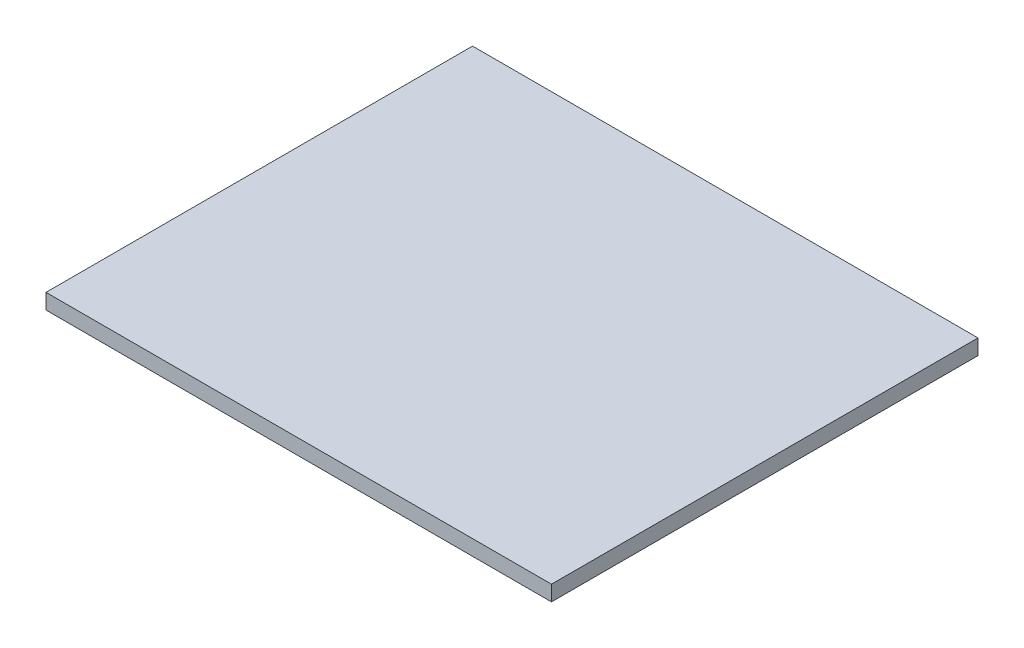
ISO-10303-21;
HEADER;
FILE_DESCRIPTION(('STEP AP214'),'2;1');
FILE_NAME('part.step','',(''),(''),'','','');
FILE_SCHEMA(('AUTOMOTIVE_DESIGN { 1 0 10303 214 1 1 1 1 }'));
ENDSEC;
DATA;
#1=APPLICATION_CONTEXT('core data for automotive mechanical design processes');
#2=APPLICATION_PROTOCOL_DEFINITION('international standard','automotive_design',2000,#1);
#3=PRODUCT_CONTEXT('',#1,'mechanical');
#4=PRODUCT('Part','Part','',(#3));
#5=PRODUCT_RELATED_PRODUCT_CATEGORY('part','',(#4));
#6=PRODUCT_DEFINITION_FORMATION('','',#4);
#7=PRODUCT_DEFINITION_CONTEXT('part definition',#1,'design');
#8=PRODUCT_DEFINITION('design','',#6,#7);
#9=PRODUCT_DEFINITION_SHAPE('','',#8);
#10=(LENGTH_UNIT() NAMED_UNIT(*) SI_UNIT(.MILLI.,.METRE.));
#11=(NAMED_UNIT(*) PLANE_ANGLE_UNIT() SI_UNIT($,.RADIAN.));
#12=(NAMED_UNIT(*) SI_UNIT($,.STERADIAN.) SOLID_ANGLE_UNIT());
#13=UNCERTAINTY_MEASURE_WITH_UNIT(LENGTH_MEASURE(1.E-05),#10,'distance_accuracy_value','');
#14=(GEOMETRIC_REPRESENTATION_CONTEXT(3) GLOBAL_UNCERTAINTY_ASSIGNED_CONTEXT((#13)) GLOBAL_UNIT_ASSIGNED_CONTEXT((#10,
#11,#12)) REPRESENTATION_CONTEXT('',''));
#15=CARTESIAN_POINT('',(0.,0.,0.));
#16=DIRECTION('',(0.,0.,1.));
#17=DIRECTION('',(1.,0.,0.));
#18=AXIS2_PLACEMENT_3D('',#15,#16,#17);
#19=CARTESIAN_POINT('',(-44.44,2.7,-37.5));
#20=DIRECTION('',(1.,0.,0.));
#21=DIRECTION('',(0.,0.,-1.));
#22=AXIS2_PLACEMENT_3D('',#19,#20,#21);
#23=PLANE('',#22);
#24=DIRECTION('',(0.,0.,1.));
#25=VECTOR('',#24,1.);
#26=CARTESIAN_POINT('',(-44.44,0.,-37.5));
#27=LINE('',#26,#25);
#28=CARTESIAN_POINT('',(-44.44,0.,-37.5));
#29=VERTEX_POINT('',#28);
#30=CARTESIAN_POINT('',(-44.44,0.,37.5));
#31=VERTEX_POINT('',#30);
#32=EDGE_CURVE('E98',#29,#31,#27,.T.);
#33=ORIENTED_EDGE('',*,*,#32,.T.);
#34=DIRECTION('',(0.,-1.,0.));
#35=VECTOR('',#34,1.);
#36=CARTESIAN_POINT('',(-44.44,2.7,37.5));
#37=LINE('',#36,#35);
#38=CARTESIAN_POINT('',(-44.44,2.7,37.5));
#39=VERTEX_POINT('',#38);
#40=EDGE_CURVE('E11',#39,#31,#37,.T.);
#41=ORIENTED_EDGE('',*,*,#40,.F.);
#42=DIRECTION('',(0.,0.,1.));
#43=VECTOR('',#42,1.);
#44=CARTESIAN_POINT('',(-44.44,2.7,-37.5));
#45=LINE('',#44,#43);
#46=CARTESIAN_POINT('',(-44.44,2.7,-37.5));
#47=VERTEX_POINT('',#46);
#48=EDGE_CURVE('E86',#47,#39,#45,.T.);
#49=ORIENTED_EDGE('',*,*,#48,.F.);
#50=DIRECTION('',(0.,-1.,0.));
#51=VECTOR('',#50,1.);
#52=CARTESIAN_POINT('',(-44.44,2.7,-37.5));
#53=LINE('',#52,#51);
#54=EDGE_CURVE('E94',#47,#29,#53,.T.);
#55=ORIENTED_EDGE('',*,*,#54,.T.);
#56=EDGE_LOOP('',(#33,#41,#49,#55));
#57=FACE_BOUND('',#56,.T.);
#58=ADVANCED_FACE('F35',(#57),#23,.F.);
#59=CARTESIAN_POINT('',(-44.44,2.7,37.5));
#60=DIRECTION('',(0.,0.,-1.));
#61=DIRECTION('',(-1.,0.,0.));
#62=AXIS2_PLACEMENT_3D('',#59,#60,#61);
#63=PLANE('',#62);
#64=DIRECTION('',(1.,0.,0.));
#65=VECTOR('',#64,1.);
#66=CARTESIAN_POINT('',(-44.44,0.,37.5));
#67=LINE('',#66,#65);
#68=CARTESIAN_POINT('',(44.44,0.,37.5));
#69=VERTEX_POINT('',#68);
#70=EDGE_CURVE('E90',#31,#69,#67,.T.);
#71=ORIENTED_EDGE('',*,*,#70,.T.);
#72=DIRECTION('',(0.,-1.,0.));
#73=VECTOR('',#72,1.);
#74=CARTESIAN_POINT('',(44.44,2.7,37.5));
#75=LINE('',#74,#73);
#76=CARTESIAN_POINT('',(44.44,2.7,37.5));
#77=VERTEX_POINT('',#76);
#78=EDGE_CURVE('E43',#77,#69,#75,.T.);
#79=ORIENTED_EDGE('',*,*,#78,.F.);
#80=DIRECTION('',(1.,0.,0.));
#81=VECTOR('',#80,1.);
#82=CARTESIAN_POINT('',(-44.44,2.7,37.5));
#83=LINE('',#82,#81);
#84=EDGE_CURVE('E81',#39,#77,#83,.T.);
#85=ORIENTED_EDGE('',*,*,#84,.F.);
#86=ORIENTED_EDGE('',*,*,#40,.T.);
#87=EDGE_LOOP('',(#71,#79,#85,#86));
#88=FACE_BOUND('',#87,.T.);
#89=ADVANCED_FACE('F89',(#88),#63,.F.);
#90=CARTESIAN_POINT('',(44.44,2.7,-37.5));
#91=DIRECTION('',(-1.,0.,0.));
#92=DIRECTION('',(0.,0.,1.));
#93=AXIS2_PLACEMENT_3D('',#90,#91,#92);
#94=PLANE('',#93);
#95=DIRECTION('',(0.,0.,-1.));
#96=VECTOR('',#95,1.);
#97=CARTESIAN_POINT('',(44.44,0.,-37.5));
#98=LINE('',#97,#96);
#99=CARTESIAN_POINT('',(44.44,0.,-37.5));
#100=VERTEX_POINT('',#99);
#101=EDGE_CURVE('E68',#69,#100,#98,.T.);
#102=ORIENTED_EDGE('',*,*,#101,.T.);
#103=DIRECTION('',(0.,-1.,0.));
#104=VECTOR('',#103,1.);
#105=CARTESIAN_POINT('',(44.44,2.7,-37.5));
#106=LINE('',#105,#104);
#107=CARTESIAN_POINT('',(44.44,2.7,-37.5));
#108=VERTEX_POINT('',#107);
#109=EDGE_CURVE('E91',#108,#100,#106,.T.);
#110=ORIENTED_EDGE('',*,*,#109,.F.);
#111=DIRECTION('',(0.,0.,-1.));
#112=VECTOR('',#111,1.);
#113=CARTESIAN_POINT('',(44.44,2.7,-37.5));
#114=LINE('',#113,#112);
#115=EDGE_CURVE('E84',#77,#108,#114,.T.);
#116=ORIENTED_EDGE('',*,*,#115,.F.);
#117=ORIENTED_EDGE('',*,*,#78,.T.);
#118=EDGE_LOOP('',(#102,#110,#116,#117));
#119=FACE_BOUND('',#118,.T.);
#120=ADVANCED_FACE('F92',(#119),#94,.F.);
#121=CARTESIAN_POINT('',(-44.44,2.7,-37.5));
#122=DIRECTION('',(0.,0.,1.));
#123=DIRECTION('',(1.,0.,0.));
#124=AXIS2_PLACEMENT_3D('',#121,#122,#123);
#125=PLANE('',#124);
#126=DIRECTION('',(-1.,0.,0.));
#127=VECTOR('',#126,1.);
#128=CARTESIAN_POINT('',(-44.44,0.,-37.5));
#129=LINE('',#128,#127);
#130=EDGE_CURVE('E74',#100,#29,#129,.T.);
#131=ORIENTED_EDGE('',*,*,#130,.T.);
#132=ORIENTED_EDGE('',*,*,#54,.F.);
#133=DIRECTION('',(-1.,0.,0.));
#134=VECTOR('',#133,1.);
#135=CARTESIAN_POINT('',(-44.44,2.7,-37.5));
#136=LINE('',#135,#134);
#137=EDGE_CURVE('E51',#108,#47,#136,.T.);
#138=ORIENTED_EDGE('',*,*,#137,.F.);
#139=ORIENTED_EDGE('',*,*,#109,.T.);
#140=EDGE_LOOP('',(#131,#132,#138,#139));
#141=FACE_BOUND('',#140,.T.);
#142=ADVANCED_FACE('F105',(#141),#125,.F.);
#143=CARTESIAN_POINT('',(0.,2.7,0.));
#144=DIRECTION('',(0.,1.,0.));
#145=DIRECTION('',(0.,0.,1.));
#146=AXIS2_PLACEMENT_3D('',#143,#144,#145);
#147=PLANE('',#146);
#148=ORIENTED_EDGE('',*,*,#48,.T.);
#149=ORIENTED_EDGE('',*,*,#84,.T.);
#150=ORIENTED_EDGE('',*,*,#115,.T.);
#151=ORIENTED_EDGE('',*,*,#137,.T.);
#152=EDGE_LOOP('',(#148,#149,#150,#151));
#153=FACE_BOUND('',#152,.T.);
#154=ADVANCED_FACE('F82',(#153),#147,.T.);
#155=CARTESIAN_POINT('',(0.,0.,0.));
#156=DIRECTION('',(0.,1.,0.));
#157=DIRECTION('',(0.,0.,1.));
#158=AXIS2_PLACEMENT_3D('',#155,#156,#157);
#159=PLANE('',#158);
#160=ORIENTED_EDGE('',*,*,#32,.F.);
#161=ORIENTED_EDGE('',*,*,#130,.F.);
#162=ORIENTED_EDGE('',*,*,#101,.F.);
#163=ORIENTED_EDGE('',*,*,#70,.F.);
#164=EDGE_LOOP('',(#160,#161,#162,#163));
#165=FACE_BOUND('',#164,.T.);
#166=ADVANCED_FACE('F108',(#165),#159,.F.);
#167=CLOSED_SHELL('',(#58,#89,#120,#142,#154,#166));
#168=MANIFOLD_SOLID_BREP('B2',#167);
#169=ADVANCED_BREP_SHAPE_REPRESENTATION('',(#18,#168),#14);
#170=SHAPE_DEFINITION_REPRESENTATION(#9,#169);
ENDSEC;
END-ISO-10303-21;
